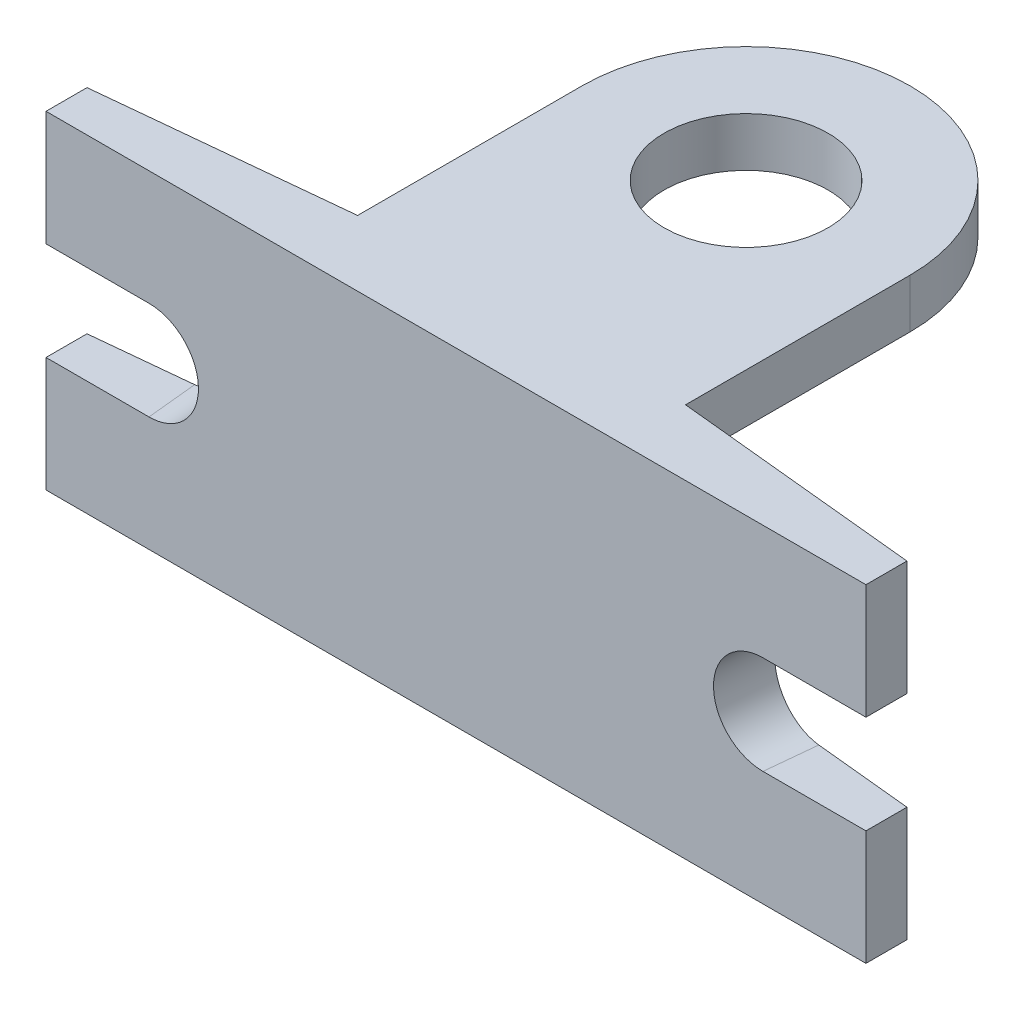
ISO-10303-21;
HEADER;
FILE_DESCRIPTION(('STEP AP214'),'2;1');
FILE_NAME('part.step','',(''),(''),'','','');
FILE_SCHEMA(('AUTOMOTIVE_DESIGN { 1 0 10303 214 1 1 1 1 }'));
ENDSEC;
DATA;
#1=APPLICATION_CONTEXT('core data for automotive mechanical design processes');
#2=APPLICATION_PROTOCOL_DEFINITION('international standard','automotive_design',2000,#1);
#3=PRODUCT_CONTEXT('',#1,'mechanical');
#4=PRODUCT('Part','Part','',(#3));
#5=PRODUCT_RELATED_PRODUCT_CATEGORY('part','',(#4));
#6=PRODUCT_DEFINITION_FORMATION('','',#4);
#7=PRODUCT_DEFINITION_CONTEXT('part definition',#1,'design');
#8=PRODUCT_DEFINITION('design','',#6,#7);
#9=PRODUCT_DEFINITION_SHAPE('','',#8);
#10=(LENGTH_UNIT() NAMED_UNIT(*) SI_UNIT(.MILLI.,.METRE.));
#11=(NAMED_UNIT(*) PLANE_ANGLE_UNIT() SI_UNIT($,.RADIAN.));
#12=(NAMED_UNIT(*) SI_UNIT($,.STERADIAN.) SOLID_ANGLE_UNIT());
#13=UNCERTAINTY_MEASURE_WITH_UNIT(LENGTH_MEASURE(1.E-05),#10,'distance_accuracy_value','');
#14=(GEOMETRIC_REPRESENTATION_CONTEXT(3) GLOBAL_UNCERTAINTY_ASSIGNED_CONTEXT((#13)) GLOBAL_UNIT_ASSIGNED_CONTEXT((#10,
#11,#12)) REPRESENTATION_CONTEXT('',''));
#15=CARTESIAN_POINT('',(0.,0.,0.));
#16=DIRECTION('',(0.,0.,1.));
#17=DIRECTION('',(1.,0.,0.));
#18=AXIS2_PLACEMENT_3D('',#15,#16,#17);
#19=CARTESIAN_POINT('',(250.,200.,0.));
#20=DIRECTION('',(-1.,0.,0.));
#21=DIRECTION('',(0.,0.,1.));
#22=AXIS2_PLACEMENT_3D('',#19,#20,#21);
#23=PLANE('',#22);
#24=DIRECTION('',(0.,-1.,0.));
#25=VECTOR('',#24,1.);
#26=CARTESIAN_POINT('',(250.,200.,-25.));
#27=LINE('',#26,#25);
#28=CARTESIAN_POINT('',(250.,70.,-25.));
#29=VERTEX_POINT('',#28);
#30=CARTESIAN_POINT('',(250.,0.,-25.));
#31=VERTEX_POINT('',#30);
#32=EDGE_CURVE('E332',#29,#31,#27,.T.);
#33=ORIENTED_EDGE('',*,*,#32,.F.);
#34=DIRECTION('',(0.,0.,1.));
#35=VECTOR('',#34,1.);
#36=CARTESIAN_POINT('',(250.,70.,0.));
#37=LINE('',#36,#35);
#38=CARTESIAN_POINT('',(250.,70.,0.));
#39=VERTEX_POINT('',#38);
#40=EDGE_CURVE('E226',#29,#39,#37,.T.);
#41=ORIENTED_EDGE('',*,*,#40,.T.);
#42=DIRECTION('',(0.,-1.,0.));
#43=VECTOR('',#42,1.);
#44=CARTESIAN_POINT('',(250.,200.,0.));
#45=LINE('',#44,#43);
#46=CARTESIAN_POINT('',(250.,0.,0.));
#47=VERTEX_POINT('',#46);
#48=EDGE_CURVE('E291',#39,#47,#45,.T.);
#49=ORIENTED_EDGE('',*,*,#48,.T.);
#50=DIRECTION('',(0.,0.,-1.));
#51=VECTOR('',#50,1.);
#52=CARTESIAN_POINT('',(250.,0.,0.));
#53=LINE('',#52,#51);
#54=EDGE_CURVE('E268',#47,#31,#53,.T.);
#55=ORIENTED_EDGE('',*,*,#54,.T.);
#56=EDGE_LOOP('',(#33,#41,#49,#55));
#57=FACE_BOUND('',#56,.T.);
#58=ADVANCED_FACE('F32',(#57),#23,.F.);
#59=CARTESIAN_POINT('',(-250.,200.,0.));
#60=DIRECTION('',(1.,0.,0.));
#61=DIRECTION('',(0.,0.,-1.));
#62=AXIS2_PLACEMENT_3D('',#59,#60,#61);
#63=PLANE('',#62);
#64=DIRECTION('',(0.,-1.,0.));
#65=VECTOR('',#64,1.);
#66=CARTESIAN_POINT('',(-250.,200.,-25.));
#67=LINE('',#66,#65);
#68=CARTESIAN_POINT('',(-250.,200.,-25.));
#69=VERTEX_POINT('',#68);
#70=CARTESIAN_POINT('',(-250.,130.,-25.));
#71=VERTEX_POINT('',#70);
#72=EDGE_CURVE('E320',#69,#71,#67,.T.);
#73=ORIENTED_EDGE('',*,*,#72,.T.);
#74=DIRECTION('',(0.,0.,1.));
#75=VECTOR('',#74,1.);
#76=CARTESIAN_POINT('',(-250.,130.,0.));
#77=LINE('',#76,#75);
#78=CARTESIAN_POINT('',(-250.,130.,0.));
#79=VERTEX_POINT('',#78);
#80=EDGE_CURVE('E244',#71,#79,#77,.T.);
#81=ORIENTED_EDGE('',*,*,#80,.T.);
#82=DIRECTION('',(0.,-1.,0.));
#83=VECTOR('',#82,1.);
#84=CARTESIAN_POINT('',(-250.,200.,0.));
#85=LINE('',#84,#83);
#86=CARTESIAN_POINT('',(-250.,200.,0.));
#87=VERTEX_POINT('',#86);
#88=EDGE_CURVE('E316',#87,#79,#85,.T.);
#89=ORIENTED_EDGE('',*,*,#88,.F.);
#90=DIRECTION('',(0.,0.,1.));
#91=VECTOR('',#90,1.);
#92=CARTESIAN_POINT('',(-250.,200.,0.));
#93=LINE('',#92,#91);
#94=EDGE_CURVE('E287',#69,#87,#93,.T.);
#95=ORIENTED_EDGE('',*,*,#94,.F.);
#96=EDGE_LOOP('',(#73,#81,#89,#95));
#97=FACE_BOUND('',#96,.T.);
#98=ADVANCED_FACE('F376',(#97),#63,.F.);
#99=CARTESIAN_POINT('',(250.,200.,0.));
#100=VERTEX_POINT('',#99);
#101=CARTESIAN_POINT('',(250.,130.,0.));
#102=VERTEX_POINT('',#101);
#103=EDGE_CURVE('E312',#100,#102,#45,.T.);
#104=ORIENTED_EDGE('',*,*,#103,.T.);
#105=DIRECTION('',(0.,0.,-1.));
#106=VECTOR('',#105,1.);
#107=CARTESIAN_POINT('',(250.,130.,0.));
#108=LINE('',#107,#106);
#109=CARTESIAN_POINT('',(250.,130.,-25.));
#110=VERTEX_POINT('',#109);
#111=EDGE_CURVE('E55',#102,#110,#108,.T.);
#112=ORIENTED_EDGE('',*,*,#111,.T.);
#113=CARTESIAN_POINT('',(250.,200.,-25.));
#114=VERTEX_POINT('',#113);
#115=EDGE_CURVE('E333',#114,#110,#27,.T.);
#116=ORIENTED_EDGE('',*,*,#115,.F.);
#117=DIRECTION('',(0.,0.,-1.));
#118=VECTOR('',#117,1.);
#119=CARTESIAN_POINT('',(250.,200.,0.));
#120=LINE('',#119,#118);
#121=EDGE_CURVE('E275',#100,#114,#120,.T.);
#122=ORIENTED_EDGE('',*,*,#121,.F.);
#123=EDGE_LOOP('',(#104,#112,#116,#122));
#124=FACE_BOUND('',#123,.T.);
#125=ADVANCED_FACE('F34',(#124),#23,.F.);
#126=CARTESIAN_POINT('',(250.,200.,-25.));
#127=DIRECTION('',(-0.0995037190209991,0.,0.995037190209989));
#128=DIRECTION('',(0.995037190209989,0.,0.0995037190209991));
#129=AXIS2_PLACEMENT_3D('',#126,#127,#128);
#130=PLANE('',#129);
#131=CARTESIAN_POINT('',(190.297768587401,100.,-30.97022314126));
#132=DIRECTION('',(0.0995037190209991,0.,-0.995037190209989));
#133=DIRECTION('',(-0.995037190209989,0.,-0.0995037190209991));
#134=AXIS2_PLACEMENT_3D('',#131,#132,#133);
#135=CIRCLE('',#134,30.);
#136=CARTESIAN_POINT('',(190.297768587401,70.,-30.97022314126));
#137=VERTEX_POINT('',#136);
#138=CARTESIAN_POINT('',(190.297768587401,130.,-30.97022314126));
#139=VERTEX_POINT('',#138);
#140=EDGE_CURVE('E212',#137,#139,#135,.T.);
#141=ORIENTED_EDGE('',*,*,#140,.F.);
#142=DIRECTION('',(-0.995037190209989,0.,-0.0995037190209991));
#143=VECTOR('',#142,1.);
#144=CARTESIAN_POINT('',(318.984497482753,70.,-18.1015502517247));
#145=LINE('',#144,#143);
#146=EDGE_CURVE('E218',#29,#137,#145,.T.);
#147=ORIENTED_EDGE('',*,*,#146,.F.);
#148=ORIENTED_EDGE('',*,*,#32,.T.);
#149=DIRECTION('',(-0.995037190209989,0.,-0.0995037190209991));
#150=VECTOR('',#149,1.);
#151=CARTESIAN_POINT('',(250.,0.,-25.));
#152=LINE('',#151,#150);
#153=CARTESIAN_POINT('',(100.,0.,-40.));
#154=VERTEX_POINT('',#153);
#155=EDGE_CURVE('E294',#31,#154,#152,.T.);
#156=ORIENTED_EDGE('',*,*,#155,.T.);
#157=DIRECTION('',(0.,-1.,0.));
#158=VECTOR('',#157,1.);
#159=CARTESIAN_POINT('',(100.,200.,-40.));
#160=LINE('',#159,#158);
#161=CARTESIAN_POINT('',(100.,200.,-40.));
#162=VERTEX_POINT('',#161);
#163=EDGE_CURVE('E329',#162,#154,#160,.T.);
#164=ORIENTED_EDGE('',*,*,#163,.F.);
#165=DIRECTION('',(-0.995037190209989,0.,-0.0995037190209991));
#166=VECTOR('',#165,1.);
#167=CARTESIAN_POINT('',(250.,200.,-25.));
#168=LINE('',#167,#166);
#169=EDGE_CURVE('E278',#114,#162,#168,.T.);
#170=ORIENTED_EDGE('',*,*,#169,.F.);
#171=ORIENTED_EDGE('',*,*,#115,.T.);
#172=DIRECTION('',(0.995037190209989,0.,0.0995037190209991));
#173=VECTOR('',#172,1.);
#174=CARTESIAN_POINT('',(190.297768587401,130.,-30.97022314126));
#175=LINE('',#174,#173);
#176=EDGE_CURVE('E216',#139,#110,#175,.T.);
#177=ORIENTED_EDGE('',*,*,#176,.F.);
#178=EDGE_LOOP('',(#141,#147,#148,#156,#164,#170,#171,#177));
#179=FACE_BOUND('',#178,.T.);
#180=ADVANCED_FACE('F362',(#179),#130,.F.);
#181=CARTESIAN_POINT('',(100.,200.,-40.));
#182=DIRECTION('',(-1.,0.,0.));
#183=DIRECTION('',(0.,0.,1.));
#184=AXIS2_PLACEMENT_3D('',#181,#182,#183);
#185=PLANE('',#184);
#186=DIRECTION('',(0.,0.,-1.));
#187=VECTOR('',#186,1.);
#188=CARTESIAN_POINT('',(100.,0.,-40.));
#189=LINE('',#188,#187);
#190=CARTESIAN_POINT('',(100.,0.,-50.));
#191=VERTEX_POINT('',#190);
#192=EDGE_CURVE('E296',#154,#191,#189,.T.);
#193=ORIENTED_EDGE('',*,*,#192,.T.);
#194=DIRECTION('',(0.,-1.,0.));
#195=VECTOR('',#194,1.);
#196=CARTESIAN_POINT('',(100.,200.,-50.));
#197=LINE('',#196,#195);
#198=CARTESIAN_POINT('',(100.,170.,-50.));
#199=VERTEX_POINT('',#198);
#200=EDGE_CURVE('E202',#199,#191,#197,.T.);
#201=ORIENTED_EDGE('',*,*,#200,.F.);
#202=DIRECTION('',(0.,0.,-1.));
#203=VECTOR('',#202,1.);
#204=CARTESIAN_POINT('',(100.,170.,-50.));
#205=LINE('',#204,#203);
#206=CARTESIAN_POINT('',(100.,170.,-176.907463649964));
#207=VERTEX_POINT('',#206);
#208=EDGE_CURVE('E47',#199,#207,#205,.T.);
#209=ORIENTED_EDGE('',*,*,#208,.T.);
#210=DIRECTION('',(0.,1.,0.));
#211=VECTOR('',#210,1.);
#212=CARTESIAN_POINT('',(100.,170.,-176.907463649964));
#213=LINE('',#212,#211);
#214=CARTESIAN_POINT('',(100.,200.,-176.907463649964));
#215=VERTEX_POINT('',#214);
#216=EDGE_CURVE('E184',#207,#215,#213,.T.);
#217=ORIENTED_EDGE('',*,*,#216,.T.);
#218=DIRECTION('',(0.,0.,-1.));
#219=VECTOR('',#218,1.);
#220=CARTESIAN_POINT('',(100.,200.,-40.));
#221=LINE('',#220,#219);
#222=EDGE_CURVE('E281',#162,#215,#221,.T.);
#223=ORIENTED_EDGE('',*,*,#222,.F.);
#224=ORIENTED_EDGE('',*,*,#163,.T.);
#225=EDGE_LOOP('',(#193,#201,#209,#217,#223,#224));
#226=FACE_BOUND('',#225,.T.);
#227=ADVANCED_FACE('F201',(#226),#185,.F.);
#228=CARTESIAN_POINT('',(100.,200.,-50.));
#229=DIRECTION('',(0.,0.,1.));
#230=DIRECTION('',(1.,0.,0.));
#231=AXIS2_PLACEMENT_3D('',#228,#229,#230);
#232=PLANE('',#231);
#233=DIRECTION('',(0.,-1.,0.));
#234=VECTOR('',#233,1.);
#235=CARTESIAN_POINT('',(-100.,200.,-50.));
#236=LINE('',#235,#234);
#237=CARTESIAN_POINT('',(-100.,170.,-50.));
#238=VERTEX_POINT('',#237);
#239=CARTESIAN_POINT('',(-100.,0.,-50.));
#240=VERTEX_POINT('',#239);
#241=EDGE_CURVE('E326',#238,#240,#236,.T.);
#242=ORIENTED_EDGE('',*,*,#241,.F.);
#243=DIRECTION('',(1.,0.,0.));
#244=VECTOR('',#243,1.);
#245=CARTESIAN_POINT('',(100.,170.,-50.));
#246=LINE('',#245,#244);
#247=EDGE_CURVE('E193',#238,#199,#246,.T.);
#248=ORIENTED_EDGE('',*,*,#247,.T.);
#249=ORIENTED_EDGE('',*,*,#200,.T.);
#250=DIRECTION('',(-1.,0.,0.));
#251=VECTOR('',#250,1.);
#252=CARTESIAN_POINT('',(100.,0.,-50.));
#253=LINE('',#252,#251);
#254=CARTESIAN_POINT('',(40.,0.,-50.));
#255=VERTEX_POINT('',#254);
#256=EDGE_CURVE('E299',#191,#255,#253,.T.);
#257=ORIENTED_EDGE('',*,*,#256,.T.);
#258=DIRECTION('',(0.,-1.,0.));
#259=VECTOR('',#258,1.);
#260=CARTESIAN_POINT('',(40.,90.3999514737899,-50.));
#261=LINE('',#260,#259);
#262=CARTESIAN_POINT('',(40.,90.3999514737899,-50.));
#263=VERTEX_POINT('',#262);
#264=EDGE_CURVE('E262',#263,#255,#261,.T.);
#265=ORIENTED_EDGE('',*,*,#264,.F.);
#266=CARTESIAN_POINT('',(0.,90.3999514737899,-50.));
#267=DIRECTION('',(0.,0.,-1.));
#268=DIRECTION('',(-1.,0.,0.));
#269=AXIS2_PLACEMENT_3D('',#266,#267,#268);
#270=CIRCLE('',#269,40.);
#271=CARTESIAN_POINT('',(-40.,90.3999514737899,-50.));
#272=VERTEX_POINT('',#271);
#273=EDGE_CURVE('E247',#272,#263,#270,.T.);
#274=ORIENTED_EDGE('',*,*,#273,.F.);
#275=DIRECTION('',(0.,1.,0.));
#276=VECTOR('',#275,1.);
#277=CARTESIAN_POINT('',(-40.,90.3999514737899,-50.));
#278=LINE('',#277,#276);
#279=CARTESIAN_POINT('',(-40.,0.,-50.));
#280=VERTEX_POINT('',#279);
#281=EDGE_CURVE('E252',#280,#272,#278,.T.);
#282=ORIENTED_EDGE('',*,*,#281,.F.);
#283=EDGE_CURVE('E298',#280,#240,#253,.T.);
#284=ORIENTED_EDGE('',*,*,#283,.T.);
#285=EDGE_LOOP('',(#242,#248,#249,#257,#265,#274,#282,#284));
#286=FACE_BOUND('',#285,.T.);
#287=ADVANCED_FACE('F415',(#286),#232,.F.);
#288=CARTESIAN_POINT('',(-100.,200.,-40.));
#289=DIRECTION('',(1.,0.,0.));
#290=DIRECTION('',(0.,0.,-1.));
#291=AXIS2_PLACEMENT_3D('',#288,#289,#290);
#292=PLANE('',#291);
#293=DIRECTION('',(0.,0.,1.));
#294=VECTOR('',#293,1.);
#295=CARTESIAN_POINT('',(-100.,0.,-40.));
#296=LINE('',#295,#294);
#297=CARTESIAN_POINT('',(-100.,0.,-40.));
#298=VERTEX_POINT('',#297);
#299=EDGE_CURVE('E302',#240,#298,#296,.T.);
#300=ORIENTED_EDGE('',*,*,#299,.T.);
#301=DIRECTION('',(0.,-1.,0.));
#302=VECTOR('',#301,1.);
#303=CARTESIAN_POINT('',(-100.,200.,-40.));
#304=LINE('',#303,#302);
#305=CARTESIAN_POINT('',(-100.,200.,-40.));
#306=VERTEX_POINT('',#305);
#307=EDGE_CURVE('E323',#306,#298,#304,.T.);
#308=ORIENTED_EDGE('',*,*,#307,.F.);
#309=DIRECTION('',(0.,0.,1.));
#310=VECTOR('',#309,1.);
#311=CARTESIAN_POINT('',(-100.,200.,-40.));
#312=LINE('',#311,#310);
#313=CARTESIAN_POINT('',(-100.,200.,-176.907463649964));
#314=VERTEX_POINT('',#313);
#315=EDGE_CURVE('E283',#314,#306,#312,.T.);
#316=ORIENTED_EDGE('',*,*,#315,.F.);
#317=DIRECTION('',(0.,1.,0.));
#318=VECTOR('',#317,1.);
#319=CARTESIAN_POINT('',(-100.,170.,-176.907463649964));
#320=LINE('',#319,#318);
#321=CARTESIAN_POINT('',(-100.,170.,-176.907463649964));
#322=VERTEX_POINT('',#321);
#323=EDGE_CURVE('E192',#322,#314,#320,.T.);
#324=ORIENTED_EDGE('',*,*,#323,.F.);
#325=DIRECTION('',(0.,0.,1.));
#326=VECTOR('',#325,1.);
#327=CARTESIAN_POINT('',(-100.,170.,-50.));
#328=LINE('',#327,#326);
#329=EDGE_CURVE('E197',#322,#238,#328,.T.);
#330=ORIENTED_EDGE('',*,*,#329,.T.);
#331=ORIENTED_EDGE('',*,*,#241,.T.);
#332=EDGE_LOOP('',(#300,#308,#316,#324,#330,#331));
#333=FACE_BOUND('',#332,.T.);
#334=ADVANCED_FACE('F407',(#333),#292,.F.);
#335=CARTESIAN_POINT('',(-250.,200.,-25.));
#336=DIRECTION('',(0.0995037190209991,0.,0.995037190209989));
#337=DIRECTION('',(0.995037190209989,0.,-0.0995037190209991));
#338=AXIS2_PLACEMENT_3D('',#335,#336,#337);
#339=PLANE('',#338);
#340=CARTESIAN_POINT('',(-190.297768587401,100.,-30.97022314126));
#341=DIRECTION('',(-0.0995037190209991,0.,-0.995037190209989));
#342=DIRECTION('',(-0.995037190209989,0.,0.0995037190209991));
#343=AXIS2_PLACEMENT_3D('',#340,#341,#342);
#344=CIRCLE('',#343,30.);
#345=CARTESIAN_POINT('',(-190.297768587401,130.,-30.97022314126));
#346=VERTEX_POINT('',#345);
#347=CARTESIAN_POINT('',(-190.297768587401,70.,-30.97022314126));
#348=VERTEX_POINT('',#347);
#349=EDGE_CURVE('E229',#346,#348,#344,.T.);
#350=ORIENTED_EDGE('',*,*,#349,.F.);
#351=DIRECTION('',(0.995037190209989,0.,-0.0995037190209991));
#352=VECTOR('',#351,1.);
#353=CARTESIAN_POINT('',(-190.297768587401,130.,-30.97022314126));
#354=LINE('',#353,#352);
#355=EDGE_CURVE('E234',#71,#346,#354,.T.);
#356=ORIENTED_EDGE('',*,*,#355,.F.);
#357=ORIENTED_EDGE('',*,*,#72,.F.);
#358=DIRECTION('',(-0.995037190209989,0.,0.0995037190209991));
#359=VECTOR('',#358,1.);
#360=CARTESIAN_POINT('',(-250.,200.,-25.));
#361=LINE('',#360,#359);
#362=EDGE_CURVE('E285',#306,#69,#361,.T.);
#363=ORIENTED_EDGE('',*,*,#362,.F.);
#364=ORIENTED_EDGE('',*,*,#307,.T.);
#365=DIRECTION('',(-0.995037190209989,0.,0.0995037190209991));
#366=VECTOR('',#365,1.);
#367=CARTESIAN_POINT('',(-250.,0.,-25.));
#368=LINE('',#367,#366);
#369=CARTESIAN_POINT('',(-250.,0.,-25.));
#370=VERTEX_POINT('',#369);
#371=EDGE_CURVE('E304',#298,#370,#368,.T.);
#372=ORIENTED_EDGE('',*,*,#371,.T.);
#373=CARTESIAN_POINT('',(-250.,70.,-25.));
#374=VERTEX_POINT('',#373);
#375=EDGE_CURVE('E319',#374,#370,#67,.T.);
#376=ORIENTED_EDGE('',*,*,#375,.F.);
#377=DIRECTION('',(-0.995037190209989,0.,0.0995037190209991));
#378=VECTOR('',#377,1.);
#379=CARTESIAN_POINT('',(-299.864966783032,70.,-20.0135033216968));
#380=LINE('',#379,#378);
#381=EDGE_CURVE('E232',#348,#374,#380,.T.);
#382=ORIENTED_EDGE('',*,*,#381,.F.);
#383=EDGE_LOOP('',(#350,#356,#357,#363,#364,#372,#376,#382));
#384=FACE_BOUND('',#383,.T.);
#385=ADVANCED_FACE('F383',(#384),#339,.F.);
#386=CARTESIAN_POINT('',(-250.,70.,0.));
#387=VERTEX_POINT('',#386);
#388=CARTESIAN_POINT('',(-250.,0.,0.));
#389=VERTEX_POINT('',#388);
#390=EDGE_CURVE('E315',#387,#389,#85,.T.);
#391=ORIENTED_EDGE('',*,*,#390,.F.);
#392=DIRECTION('',(0.,0.,-1.));
#393=VECTOR('',#392,1.);
#394=CARTESIAN_POINT('',(-250.,70.,0.));
#395=LINE('',#394,#393);
#396=EDGE_CURVE('E240',#387,#374,#395,.T.);
#397=ORIENTED_EDGE('',*,*,#396,.T.);
#398=ORIENTED_EDGE('',*,*,#375,.T.);
#399=DIRECTION('',(0.,0.,1.));
#400=VECTOR('',#399,1.);
#401=CARTESIAN_POINT('',(-250.,0.,0.));
#402=LINE('',#401,#400);
#403=EDGE_CURVE('E307',#370,#389,#402,.T.);
#404=ORIENTED_EDGE('',*,*,#403,.T.);
#405=EDGE_LOOP('',(#391,#397,#398,#404));
#406=FACE_BOUND('',#405,.T.);
#407=ADVANCED_FACE('F392',(#406),#63,.F.);
#408=CARTESIAN_POINT('',(-250.,200.,0.));
#409=DIRECTION('',(0.,0.,-1.));
#410=DIRECTION('',(-1.,0.,0.));
#411=AXIS2_PLACEMENT_3D('',#408,#409,#410);
#412=PLANE('',#411);
#413=ORIENTED_EDGE('',*,*,#48,.F.);
#414=DIRECTION('',(-1.,0.,0.));
#415=VECTOR('',#414,1.);
#416=CARTESIAN_POINT('',(-250.,70.,0.));
#417=LINE('',#416,#415);
#418=CARTESIAN_POINT('',(187.200746273275,70.,0.));
#419=VERTEX_POINT('',#418);
#420=EDGE_CURVE('E11',#39,#419,#417,.T.);
#421=ORIENTED_EDGE('',*,*,#420,.T.);
#422=CARTESIAN_POINT('',(187.200746273275,100.,0.));
#423=DIRECTION('',(0.,0.,-1.));
#424=DIRECTION('',(1.,0.,0.));
#425=AXIS2_PLACEMENT_3D('',#422,#423,#424);
#426=ELLIPSE('',#425,30.1496268633627,30.);
#427=CARTESIAN_POINT('',(187.200746273275,130.,0.));
#428=VERTEX_POINT('',#427);
#429=EDGE_CURVE('E40',#419,#428,#426,.T.);
#430=ORIENTED_EDGE('',*,*,#429,.T.);
#431=DIRECTION('',(1.,0.,0.));
#432=VECTOR('',#431,1.);
#433=CARTESIAN_POINT('',(-250.,130.,0.));
#434=LINE('',#433,#432);
#435=EDGE_CURVE('E345',#428,#102,#434,.T.);
#436=ORIENTED_EDGE('',*,*,#435,.T.);
#437=ORIENTED_EDGE('',*,*,#103,.F.);
#438=DIRECTION('',(1.,0.,0.));
#439=VECTOR('',#438,1.);
#440=CARTESIAN_POINT('',(-250.,200.,0.));
#441=LINE('',#440,#439);
#442=EDGE_CURVE('E289',#87,#100,#441,.T.);
#443=ORIENTED_EDGE('',*,*,#442,.F.);
#444=ORIENTED_EDGE('',*,*,#88,.T.);
#445=DIRECTION('',(1.,0.,0.));
#446=VECTOR('',#445,1.);
#447=CARTESIAN_POINT('',(-250.,130.,0.));
#448=LINE('',#447,#446);
#449=CARTESIAN_POINT('',(-187.200746273275,130.,0.));
#450=VERTEX_POINT('',#449);
#451=EDGE_CURVE('E342',#79,#450,#448,.T.);
#452=ORIENTED_EDGE('',*,*,#451,.T.);
#453=CARTESIAN_POINT('',(-187.200746273275,100.,0.));
#454=DIRECTION('',(0.,0.,-1.));
#455=DIRECTION('',(-1.,0.,0.));
#456=AXIS2_PLACEMENT_3D('',#453,#454,#455);
#457=ELLIPSE('',#456,30.1496268633627,30.);
#458=CARTESIAN_POINT('',(-187.200746273275,70.,0.));
#459=VERTEX_POINT('',#458);
#460=EDGE_CURVE('E339',#450,#459,#457,.T.);
#461=ORIENTED_EDGE('',*,*,#460,.T.);
#462=DIRECTION('',(-1.,0.,0.));
#463=VECTOR('',#462,1.);
#464=CARTESIAN_POINT('',(-250.,70.,0.));
#465=LINE('',#464,#463);
#466=EDGE_CURVE('E336',#459,#387,#465,.T.);
#467=ORIENTED_EDGE('',*,*,#466,.T.);
#468=ORIENTED_EDGE('',*,*,#390,.T.);
#469=DIRECTION('',(1.,0.,0.));
#470=VECTOR('',#469,1.);
#471=CARTESIAN_POINT('',(-250.,0.,0.));
#472=LINE('',#471,#470);
#473=EDGE_CURVE('E279',#389,#47,#472,.T.);
#474=ORIENTED_EDGE('',*,*,#473,.T.);
#475=EDGE_LOOP('',(#413,#421,#430,#436,#437,#443,#444,#452,#461,#467,#468,#474));
#476=FACE_BOUND('',#475,.T.);
#477=ADVANCED_FACE('F349',(#476),#412,.F.);
#478=CARTESIAN_POINT('',(0.,200.,0.));
#479=DIRECTION('',(0.,1.,0.));
#480=DIRECTION('',(0.,0.,1.));
#481=AXIS2_PLACEMENT_3D('',#478,#479,#480);
#482=PLANE('',#481);
#483=ORIENTED_EDGE('',*,*,#121,.T.);
#484=ORIENTED_EDGE('',*,*,#169,.T.);
#485=ORIENTED_EDGE('',*,*,#222,.T.);
#486=CARTESIAN_POINT('',(0.,200.,-176.907463649964));
#487=DIRECTION('',(0.,1.,0.));
#488=DIRECTION('',(0.,0.,1.));
#489=AXIS2_PLACEMENT_3D('',#486,#487,#488);
#490=CIRCLE('',#489,100.);
#491=EDGE_CURVE('E189',#215,#314,#490,.T.);
#492=ORIENTED_EDGE('',*,*,#491,.T.);
#493=ORIENTED_EDGE('',*,*,#315,.T.);
#494=ORIENTED_EDGE('',*,*,#362,.T.);
#495=ORIENTED_EDGE('',*,*,#94,.T.);
#496=ORIENTED_EDGE('',*,*,#442,.T.);
#497=EDGE_LOOP('',(#483,#484,#485,#492,#493,#494,#495,#496));
#498=FACE_BOUND('',#497,.T.);
#499=CARTESIAN_POINT('',(0.,200.,-176.907463649964));
#500=DIRECTION('',(0.,1.,0.));
#501=DIRECTION('',(0.,0.,1.));
#502=AXIS2_PLACEMENT_3D('',#499,#500,#501);
#503=CIRCLE('',#502,50.);
#504=CARTESIAN_POINT('',(0.,200.,-126.907463649964));
#505=VERTEX_POINT('',#504);
#506=EDGE_CURVE('E207',#505,#505,#503,.T.);
#507=ORIENTED_EDGE('',*,*,#506,.F.);
#508=EDGE_LOOP('',(#507));
#509=FACE_BOUND('',#508,.T.);
#510=ADVANCED_FACE('F370',(#498,#509),#482,.T.);
#511=CARTESIAN_POINT('',(0.,0.,0.));
#512=DIRECTION('',(0.,1.,0.));
#513=DIRECTION('',(0.,0.,1.));
#514=AXIS2_PLACEMENT_3D('',#511,#512,#513);
#515=PLANE('',#514);
#516=ORIENTED_EDGE('',*,*,#283,.F.);
#517=DIRECTION('',(0.,0.,-1.));
#518=VECTOR('',#517,1.);
#519=CARTESIAN_POINT('',(-40.,0.,-20.));
#520=LINE('',#519,#518);
#521=CARTESIAN_POINT('',(-40.,0.,-20.));
#522=VERTEX_POINT('',#521);
#523=EDGE_CURVE('E269',#522,#280,#520,.T.);
#524=ORIENTED_EDGE('',*,*,#523,.F.);
#525=DIRECTION('',(-1.,0.,0.));
#526=VECTOR('',#525,1.);
#527=CARTESIAN_POINT('',(40.,0.,-20.));
#528=LINE('',#527,#526);
#529=CARTESIAN_POINT('',(40.,0.,-20.));
#530=VERTEX_POINT('',#529);
#531=EDGE_CURVE('E254',#530,#522,#528,.T.);
#532=ORIENTED_EDGE('',*,*,#531,.F.);
#533=DIRECTION('',(0.,0.,-1.));
#534=VECTOR('',#533,1.);
#535=CARTESIAN_POINT('',(40.,0.,-20.));
#536=LINE('',#535,#534);
#537=EDGE_CURVE('E271',#530,#255,#536,.T.);
#538=ORIENTED_EDGE('',*,*,#537,.T.);
#539=ORIENTED_EDGE('',*,*,#256,.F.);
#540=ORIENTED_EDGE('',*,*,#192,.F.);
#541=ORIENTED_EDGE('',*,*,#155,.F.);
#542=ORIENTED_EDGE('',*,*,#54,.F.);
#543=ORIENTED_EDGE('',*,*,#473,.F.);
#544=ORIENTED_EDGE('',*,*,#403,.F.);
#545=ORIENTED_EDGE('',*,*,#371,.F.);
#546=ORIENTED_EDGE('',*,*,#299,.F.);
#547=EDGE_LOOP('',(#516,#524,#532,#538,#539,#540,#541,#542,#543,#544,#545,#546));
#548=FACE_BOUND('',#547,.T.);
#549=ADVANCED_FACE('F399',(#548),#515,.F.);
#550=CARTESIAN_POINT('',(0.,90.3999514737899,-20.));
#551=DIRECTION('',(0.,0.,-1.));
#552=DIRECTION('',(-1.,0.,0.));
#553=AXIS2_PLACEMENT_3D('',#550,#551,#552);
#554=CYLINDRICAL_SURFACE('',#553,40.);
#555=ORIENTED_EDGE('',*,*,#273,.T.);
#556=DIRECTION('',(0.,0.,-1.));
#557=VECTOR('',#556,1.);
#558=CARTESIAN_POINT('',(40.,90.3999514737899,-20.));
#559=LINE('',#558,#557);
#560=CARTESIAN_POINT('',(40.,90.3999514737899,-20.));
#561=VERTEX_POINT('',#560);
#562=EDGE_CURVE('E259',#561,#263,#559,.T.);
#563=ORIENTED_EDGE('',*,*,#562,.F.);
#564=CARTESIAN_POINT('',(0.,90.3999514737899,-20.));
#565=DIRECTION('',(0.,0.,-1.));
#566=DIRECTION('',(-1.,0.,0.));
#567=AXIS2_PLACEMENT_3D('',#564,#565,#566);
#568=CIRCLE('',#567,40.);
#569=CARTESIAN_POINT('',(-40.,90.3999514737899,-20.));
#570=VERTEX_POINT('',#569);
#571=EDGE_CURVE('E248',#570,#561,#568,.T.);
#572=ORIENTED_EDGE('',*,*,#571,.F.);
#573=DIRECTION('',(0.,0.,-1.));
#574=VECTOR('',#573,1.);
#575=CARTESIAN_POINT('',(-40.,90.3999514737899,-20.));
#576=LINE('',#575,#574);
#577=EDGE_CURVE('E266',#570,#272,#576,.T.);
#578=ORIENTED_EDGE('',*,*,#577,.T.);
#579=EDGE_LOOP('',(#555,#563,#572,#578));
#580=FACE_BOUND('',#579,.T.);
#581=ADVANCED_FACE('F429',(#580),#554,.F.);
#582=CARTESIAN_POINT('',(-40.,90.3999514737899,-20.));
#583=DIRECTION('',(-1.,0.,0.));
#584=DIRECTION('',(0.,0.,1.));
#585=AXIS2_PLACEMENT_3D('',#582,#583,#584);
#586=PLANE('',#585);
#587=ORIENTED_EDGE('',*,*,#281,.T.);
#588=ORIENTED_EDGE('',*,*,#577,.F.);
#589=DIRECTION('',(0.,1.,0.));
#590=VECTOR('',#589,1.);
#591=CARTESIAN_POINT('',(-40.,90.3999514737899,-20.));
#592=LINE('',#591,#590);
#593=EDGE_CURVE('E256',#522,#570,#592,.T.);
#594=ORIENTED_EDGE('',*,*,#593,.F.);
#595=ORIENTED_EDGE('',*,*,#523,.T.);
#596=EDGE_LOOP('',(#587,#588,#594,#595));
#597=FACE_BOUND('',#596,.T.);
#598=ADVANCED_FACE('F419',(#597),#586,.F.);
#599=CARTESIAN_POINT('',(40.,90.3999514737899,-20.));
#600=DIRECTION('',(1.,0.,0.));
#601=DIRECTION('',(0.,0.,-1.));
#602=AXIS2_PLACEMENT_3D('',#599,#600,#601);
#603=PLANE('',#602);
#604=ORIENTED_EDGE('',*,*,#264,.T.);
#605=ORIENTED_EDGE('',*,*,#537,.F.);
#606=DIRECTION('',(0.,-1.,0.));
#607=VECTOR('',#606,1.);
#608=CARTESIAN_POINT('',(40.,90.3999514737899,-20.));
#609=LINE('',#608,#607);
#610=EDGE_CURVE('E251',#561,#530,#609,.T.);
#611=ORIENTED_EDGE('',*,*,#610,.F.);
#612=ORIENTED_EDGE('',*,*,#562,.T.);
#613=EDGE_LOOP('',(#604,#605,#611,#612));
#614=FACE_BOUND('',#613,.T.);
#615=ADVANCED_FACE('F427',(#614),#603,.F.);
#616=CARTESIAN_POINT('',(0.,90.3999514737899,-20.));
#617=DIRECTION('',(0.,0.,-1.));
#618=DIRECTION('',(-1.,0.,0.));
#619=AXIS2_PLACEMENT_3D('',#616,#617,#618);
#620=PLANE('',#619);
#621=ORIENTED_EDGE('',*,*,#571,.T.);
#622=ORIENTED_EDGE('',*,*,#610,.T.);
#623=ORIENTED_EDGE('',*,*,#531,.T.);
#624=ORIENTED_EDGE('',*,*,#593,.T.);
#625=EDGE_LOOP('',(#621,#622,#623,#624));
#626=FACE_BOUND('',#625,.T.);
#627=ADVANCED_FACE('F423',(#626),#620,.T.);
#628=CARTESIAN_POINT('',(-182.872026013143,100.,43.2872026013144));
#629=DIRECTION('',(-0.0995037190209991,0.,-0.995037190209989));
#630=DIRECTION('',(-0.995037190209989,0.,0.0995037190209991));
#631=AXIS2_PLACEMENT_3D('',#628,#629,#630);
#632=CYLINDRICAL_SURFACE('',#631,30.);
#633=DIRECTION('',(-0.0995037190209991,0.,-0.995037190209989));
#634=VECTOR('',#633,1.);
#635=CARTESIAN_POINT('',(-182.872026013143,130.,43.2872026013144));
#636=LINE('',#635,#634);
#637=EDGE_CURVE('E238',#450,#346,#636,.T.);
#638=ORIENTED_EDGE('',*,*,#637,.T.);
#639=ORIENTED_EDGE('',*,*,#349,.T.);
#640=DIRECTION('',(-0.0995037190209991,0.,-0.995037190209989));
#641=VECTOR('',#640,1.);
#642=CARTESIAN_POINT('',(-182.872026013143,70.,43.2872026013144));
#643=LINE('',#642,#641);
#644=EDGE_CURVE('E237',#459,#348,#643,.T.);
#645=ORIENTED_EDGE('',*,*,#644,.F.);
#646=ORIENTED_EDGE('',*,*,#460,.F.);
#647=EDGE_LOOP('',(#638,#639,#645,#646));
#648=FACE_BOUND('',#647,.T.);
#649=ADVANCED_FACE('F388',(#648),#632,.F.);
#650=CARTESIAN_POINT('',(-182.872026013143,130.,43.2872026013144));
#651=DIRECTION('',(0.,1.,0.));
#652=DIRECTION('',(0.,0.,1.));
#653=AXIS2_PLACEMENT_3D('',#650,#651,#652);
#654=PLANE('',#653);
#655=ORIENTED_EDGE('',*,*,#355,.T.);
#656=ORIENTED_EDGE('',*,*,#637,.F.);
#657=ORIENTED_EDGE('',*,*,#451,.F.);
#658=ORIENTED_EDGE('',*,*,#80,.F.);
#659=EDGE_LOOP('',(#655,#656,#657,#658));
#660=FACE_BOUND('',#659,.T.);
#661=ADVANCED_FACE('F379',(#660),#654,.F.);
#662=CARTESIAN_POINT('',(-292.439224208774,70.,54.2439224208775));
#663=DIRECTION('',(0.,-1.,0.));
#664=DIRECTION('',(1.,0.,0.));
#665=AXIS2_PLACEMENT_3D('',#662,#663,#664);
#666=PLANE('',#665);
#667=ORIENTED_EDGE('',*,*,#466,.F.);
#668=ORIENTED_EDGE('',*,*,#644,.T.);
#669=ORIENTED_EDGE('',*,*,#381,.T.);
#670=ORIENTED_EDGE('',*,*,#396,.F.);
#671=EDGE_LOOP('',(#667,#668,#669,#670));
#672=FACE_BOUND('',#671,.T.);
#673=ADVANCED_FACE('F536',(#672),#666,.F.);
#674=CARTESIAN_POINT('',(182.872026013143,100.,43.2872026013144));
#675=DIRECTION('',(0.0995037190209991,0.,-0.995037190209989));
#676=DIRECTION('',(-0.995037190209989,0.,-0.0995037190209991));
#677=AXIS2_PLACEMENT_3D('',#674,#675,#676);
#678=CYLINDRICAL_SURFACE('',#677,30.);
#679=DIRECTION('',(0.0995037190209991,0.,-0.995037190209989));
#680=VECTOR('',#679,1.);
#681=CARTESIAN_POINT('',(182.872026013143,70.,43.2872026013144));
#682=LINE('',#681,#680);
#683=EDGE_CURVE('E222',#419,#137,#682,.T.);
#684=ORIENTED_EDGE('',*,*,#683,.T.);
#685=ORIENTED_EDGE('',*,*,#140,.T.);
#686=DIRECTION('',(0.0995037190209991,0.,-0.995037190209989));
#687=VECTOR('',#686,1.);
#688=CARTESIAN_POINT('',(182.872026013143,130.,43.2872026013144));
#689=LINE('',#688,#687);
#690=EDGE_CURVE('E221',#428,#139,#689,.T.);
#691=ORIENTED_EDGE('',*,*,#690,.F.);
#692=ORIENTED_EDGE('',*,*,#429,.F.);
#693=EDGE_LOOP('',(#684,#685,#691,#692));
#694=FACE_BOUND('',#693,.T.);
#695=ADVANCED_FACE('F354',(#694),#678,.F.);
#696=CARTESIAN_POINT('',(311.558754908496,70.,56.1558754908497));
#697=DIRECTION('',(0.,-1.,0.));
#698=DIRECTION('',(0.,0.,-1.));
#699=AXIS2_PLACEMENT_3D('',#696,#697,#698);
#700=PLANE('',#699);
#701=ORIENTED_EDGE('',*,*,#146,.T.);
#702=ORIENTED_EDGE('',*,*,#683,.F.);
#703=ORIENTED_EDGE('',*,*,#420,.F.);
#704=ORIENTED_EDGE('',*,*,#40,.F.);
#705=EDGE_LOOP('',(#701,#702,#703,#704));
#706=FACE_BOUND('',#705,.T.);
#707=ADVANCED_FACE('F356',(#706),#700,.F.);
#708=CARTESIAN_POINT('',(182.872026013143,130.,43.2872026013144));
#709=DIRECTION('',(0.,1.,0.));
#710=DIRECTION('',(0.,0.,1.));
#711=AXIS2_PLACEMENT_3D('',#708,#709,#710);
#712=PLANE('',#711);
#713=ORIENTED_EDGE('',*,*,#435,.F.);
#714=ORIENTED_EDGE('',*,*,#690,.T.);
#715=ORIENTED_EDGE('',*,*,#176,.T.);
#716=ORIENTED_EDGE('',*,*,#111,.F.);
#717=EDGE_LOOP('',(#713,#714,#715,#716));
#718=FACE_BOUND('',#717,.T.);
#719=ADVANCED_FACE('F364',(#718),#712,.F.);
#720=CARTESIAN_POINT('',(0.,170.,-176.907463649964));
#721=DIRECTION('',(0.,1.,0.));
#722=DIRECTION('',(0.,0.,1.));
#723=AXIS2_PLACEMENT_3D('',#720,#721,#722);
#724=CYLINDRICAL_SURFACE('',#723,100.);
#725=ORIENTED_EDGE('',*,*,#491,.F.);
#726=ORIENTED_EDGE('',*,*,#216,.F.);
#727=CARTESIAN_POINT('',(0.,170.,-176.907463649964));
#728=DIRECTION('',(0.,1.,0.));
#729=DIRECTION('',(0.,0.,1.));
#730=AXIS2_PLACEMENT_3D('',#727,#728,#729);
#731=CIRCLE('',#730,100.);
#732=EDGE_CURVE('E187',#207,#322,#731,.T.);
#733=ORIENTED_EDGE('',*,*,#732,.T.);
#734=ORIENTED_EDGE('',*,*,#323,.T.);
#735=EDGE_LOOP('',(#725,#726,#733,#734));
#736=FACE_BOUND('',#735,.T.);
#737=ADVANCED_FACE('F185',(#736),#724,.T.);
#738=CARTESIAN_POINT('',(0.,170.,-176.907463649964));
#739=DIRECTION('',(0.,1.,0.));
#740=DIRECTION('',(0.,0.,1.));
#741=AXIS2_PLACEMENT_3D('',#738,#739,#740);
#742=PLANE('',#741);
#743=CARTESIAN_POINT('',(0.,170.,-176.907463649964));
#744=DIRECTION('',(0.,1.,0.));
#745=DIRECTION('',(0.,0.,1.));
#746=AXIS2_PLACEMENT_3D('',#743,#744,#745);
#747=CIRCLE('',#746,50.);
#748=CARTESIAN_POINT('',(0.,170.,-126.907463649964));
#749=VERTEX_POINT('',#748);
#750=EDGE_CURVE('E204',#749,#749,#747,.T.);
#751=ORIENTED_EDGE('',*,*,#750,.T.);
#752=EDGE_LOOP('',(#751));
#753=FACE_BOUND('',#752,.T.);
#754=ORIENTED_EDGE('',*,*,#208,.F.);
#755=ORIENTED_EDGE('',*,*,#247,.F.);
#756=ORIENTED_EDGE('',*,*,#329,.F.);
#757=ORIENTED_EDGE('',*,*,#732,.F.);
#758=EDGE_LOOP('',(#754,#755,#756,#757));
#759=FACE_BOUND('',#758,.T.);
#760=ADVANCED_FACE('F196',(#753,#759),#742,.F.);
#761=CARTESIAN_POINT('',(0.,170.,-176.907463649964));
#762=DIRECTION('',(0.,1.,0.));
#763=DIRECTION('',(0.,0.,1.));
#764=AXIS2_PLACEMENT_3D('',#761,#762,#763);
#765=CYLINDRICAL_SURFACE('',#764,50.);
#766=ORIENTED_EDGE('',*,*,#750,.F.);
#767=EDGE_LOOP('',(#766));
#768=FACE_BOUND('',#767,.T.);
#769=ORIENTED_EDGE('',*,*,#506,.T.);
#770=EDGE_LOOP('',(#769));
#771=FACE_BOUND('',#770,.T.);
#772=ADVANCED_FACE('F623',(#768,#771),#765,.F.);
#773=CLOSED_SHELL('',(#58,#98,#125,#180,#227,#287,#334,#385,#407,#477,#510,#549,#581,#598,#615,
#627,#649,#661,#673,#695,#707,#719,#737,#760,#772));
#774=MANIFOLD_SOLID_BREP('B2',#773);
#775=ADVANCED_BREP_SHAPE_REPRESENTATION('',(#18,#774),#14);
#776=SHAPE_DEFINITION_REPRESENTATION(#9,#775);
ENDSEC;
END-ISO-10303-21;
